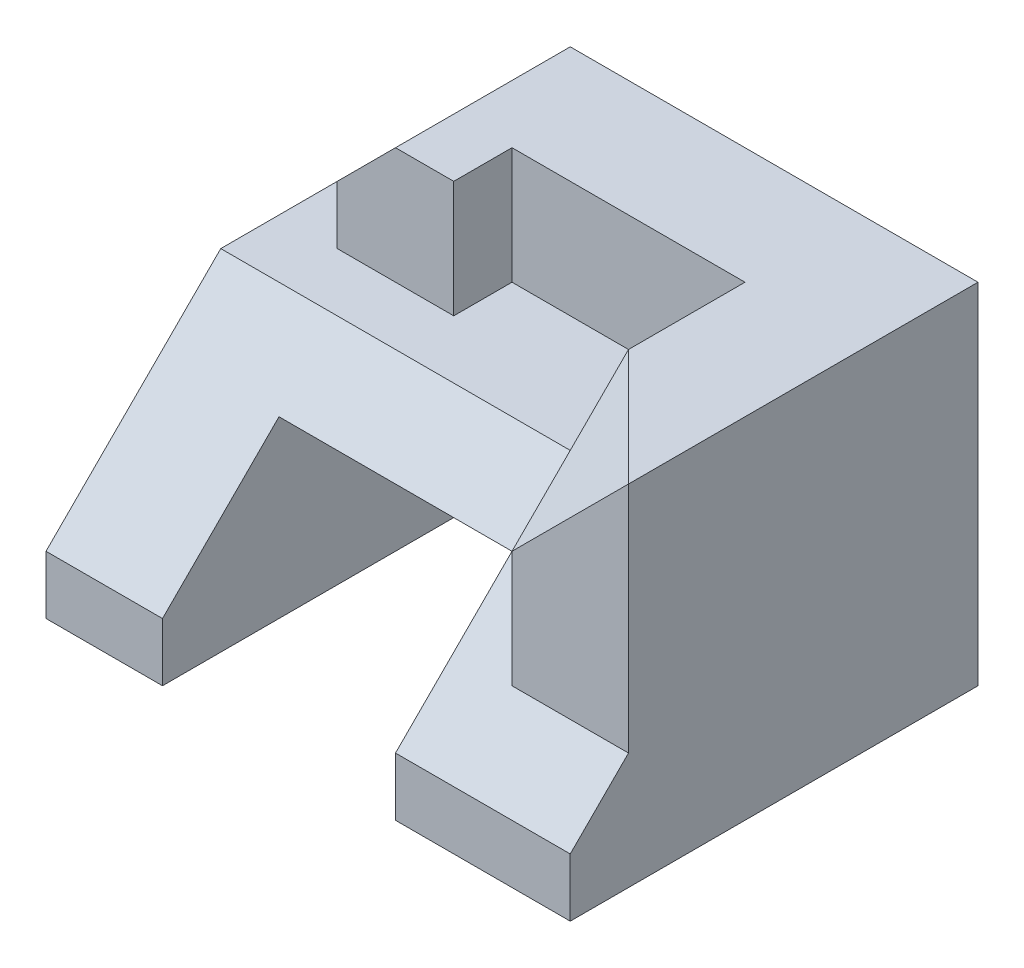
ISO-10303-21;
HEADER;
FILE_DESCRIPTION(('STEP AP214'),'2;1');
FILE_NAME('part.step','',(''),(''),'','','');
FILE_SCHEMA(('AUTOMOTIVE_DESIGN { 1 0 10303 214 1 1 1 1 }'));
ENDSEC;
DATA;
#1=APPLICATION_CONTEXT('core data for automotive mechanical design processes');
#2=APPLICATION_PROTOCOL_DEFINITION('international standard','automotive_design',2000,#1);
#3=PRODUCT_CONTEXT('',#1,'mechanical');
#4=PRODUCT('Part','Part','',(#3));
#5=PRODUCT_RELATED_PRODUCT_CATEGORY('part','',(#4));
#6=PRODUCT_DEFINITION_FORMATION('','',#4);
#7=PRODUCT_DEFINITION_CONTEXT('part definition',#1,'design');
#8=PRODUCT_DEFINITION('design','',#6,#7);
#9=PRODUCT_DEFINITION_SHAPE('','',#8);
#10=(LENGTH_UNIT() NAMED_UNIT(*) SI_UNIT(.MILLI.,.METRE.));
#11=(NAMED_UNIT(*) PLANE_ANGLE_UNIT() SI_UNIT($,.RADIAN.));
#12=(NAMED_UNIT(*) SI_UNIT($,.STERADIAN.) SOLID_ANGLE_UNIT());
#13=UNCERTAINTY_MEASURE_WITH_UNIT(LENGTH_MEASURE(1.E-05),#10,'distance_accuracy_value','');
#14=(GEOMETRIC_REPRESENTATION_CONTEXT(3) GLOBAL_UNCERTAINTY_ASSIGNED_CONTEXT((#13)) GLOBAL_UNIT_ASSIGNED_CONTEXT((#10,
#11,#12)) REPRESENTATION_CONTEXT('',''));
#15=CARTESIAN_POINT('',(0.,0.,0.));
#16=DIRECTION('',(0.,0.,1.));
#17=DIRECTION('',(1.,0.,0.));
#18=AXIS2_PLACEMENT_3D('',#15,#16,#17);
#19=CARTESIAN_POINT('',(25.,10.,15.));
#20=DIRECTION('',(0.,-0.707106781186547,-0.707106781186547));
#21=DIRECTION('',(0.,0.707106781186548,-0.707106781186548));
#22=AXIS2_PLACEMENT_3D('',#19,#20,#21);
#23=PLANE('',#22);
#24=DIRECTION('',(0.,-0.707106781186548,0.707106781186548));
#25=VECTOR('',#24,1.);
#26=CARTESIAN_POINT('',(15.,10.,15.));
#27=LINE('',#26,#25);
#28=CARTESIAN_POINT('',(15.,10.,15.));
#29=VERTEX_POINT('',#28);
#30=CARTESIAN_POINT('',(15.,0.,25.));
#31=VERTEX_POINT('',#30);
#32=EDGE_CURVE('E213',#29,#31,#27,.T.);
#33=ORIENTED_EDGE('',*,*,#32,.F.);
#34=DIRECTION('',(-1.,0.,0.));
#35=VECTOR('',#34,1.);
#36=CARTESIAN_POINT('',(25.,10.,15.));
#37=LINE('',#36,#35);
#38=CARTESIAN_POINT('',(-20.,10.,15.));
#39=VERTEX_POINT('',#38);
#40=EDGE_CURVE('E400',#29,#39,#37,.T.);
#41=ORIENTED_EDGE('',*,*,#40,.T.);
#42=DIRECTION('',(0.,-0.707106781186547,0.707106781186547));
#43=VECTOR('',#42,1.);
#44=CARTESIAN_POINT('',(-20.,10.,15.));
#45=LINE('',#44,#43);
#46=CARTESIAN_POINT('',(-20.,-5.,30.));
#47=VERTEX_POINT('',#46);
#48=EDGE_CURVE('E283',#39,#47,#45,.T.);
#49=ORIENTED_EDGE('',*,*,#48,.T.);
#50=DIRECTION('',(-1.,0.,0.));
#51=VECTOR('',#50,1.);
#52=CARTESIAN_POINT('',(25.,-5.,30.));
#53=LINE('',#52,#51);
#54=CARTESIAN_POINT('',(-9.99999999999999,-5.,30.));
#55=VERTEX_POINT('',#54);
#56=EDGE_CURVE('E399',#55,#47,#53,.T.);
#57=ORIENTED_EDGE('',*,*,#56,.F.);
#58=DIRECTION('',(0.,-0.707106781186548,0.707106781186548));
#59=VECTOR('',#58,1.);
#60=CARTESIAN_POINT('',(-10.,7.5,17.5));
#61=LINE('',#60,#59);
#62=CARTESIAN_POINT('',(-10.,5.,20.));
#63=VERTEX_POINT('',#62);
#64=EDGE_CURVE('E357',#63,#55,#61,.T.);
#65=ORIENTED_EDGE('',*,*,#64,.F.);
#66=DIRECTION('',(-1.,0.,0.));
#67=VECTOR('',#66,1.);
#68=CARTESIAN_POINT('',(-10.,5.,20.));
#69=LINE('',#68,#67);
#70=CARTESIAN_POINT('',(10.,5.,20.));
#71=VERTEX_POINT('',#70);
#72=EDGE_CURVE('E361',#71,#63,#69,.T.);
#73=ORIENTED_EDGE('',*,*,#72,.F.);
#74=DIRECTION('',(0.,0.707106781186548,-0.707106781186548));
#75=VECTOR('',#74,1.);
#76=CARTESIAN_POINT('',(10.,15.,10.));
#77=LINE('',#76,#75);
#78=CARTESIAN_POINT('',(10.,-5.,30.));
#79=VERTEX_POINT('',#78);
#80=EDGE_CURVE('E364',#79,#71,#77,.T.);
#81=ORIENTED_EDGE('',*,*,#80,.F.);
#82=CARTESIAN_POINT('',(25.,-5.,30.));
#83=VERTEX_POINT('',#82);
#84=EDGE_CURVE('E368',#83,#79,#53,.T.);
#85=ORIENTED_EDGE('',*,*,#84,.F.);
#86=DIRECTION('',(0.,-0.707106781186547,0.707106781186547));
#87=VECTOR('',#86,1.);
#88=CARTESIAN_POINT('',(25.,10.,15.));
#89=LINE('',#88,#87);
#90=CARTESIAN_POINT('',(25.,0.,25.));
#91=VERTEX_POINT('',#90);
#92=EDGE_CURVE('E403',#91,#83,#89,.T.);
#93=ORIENTED_EDGE('',*,*,#92,.F.);
#94=DIRECTION('',(-1.,0.,0.));
#95=VECTOR('',#94,1.);
#96=CARTESIAN_POINT('',(25.,0.,25.));
#97=LINE('',#96,#95);
#98=EDGE_CURVE('E196',#91,#31,#97,.T.);
#99=ORIENTED_EDGE('',*,*,#98,.T.);
#100=EDGE_LOOP('',(#33,#41,#49,#57,#65,#73,#81,#85,#93,#99));
#101=FACE_BOUND('',#100,.T.);
#102=ADVANCED_FACE('F33',(#101),#23,.F.);
#103=CARTESIAN_POINT('',(-25.,10.,30.));
#104=DIRECTION('',(0.,-1.,0.));
#105=DIRECTION('',(0.,0.,-1.));
#106=AXIS2_PLACEMENT_3D('',#103,#104,#105);
#107=PLANE('',#106);
#108=ORIENTED_EDGE('',*,*,#40,.F.);
#109=DIRECTION('',(0.,0.,1.));
#110=VECTOR('',#109,1.);
#111=CARTESIAN_POINT('',(15.,10.,5.));
#112=LINE('',#111,#110);
#113=CARTESIAN_POINT('',(15.,10.,5.));
#114=VERTEX_POINT('',#113);
#115=EDGE_CURVE('E231',#114,#29,#112,.T.);
#116=ORIENTED_EDGE('',*,*,#115,.F.);
#117=DIRECTION('',(1.,0.,0.));
#118=VECTOR('',#117,1.);
#119=CARTESIAN_POINT('',(15.,10.,5.));
#120=LINE('',#119,#118);
#121=CARTESIAN_POINT('',(-5.,10.,5.));
#122=VERTEX_POINT('',#121);
#123=EDGE_CURVE('E220',#122,#114,#120,.T.);
#124=ORIENTED_EDGE('',*,*,#123,.F.);
#125=DIRECTION('',(0.,0.,1.));
#126=VECTOR('',#125,1.);
#127=CARTESIAN_POINT('',(-5.,10.,5.));
#128=LINE('',#127,#126);
#129=CARTESIAN_POINT('',(-5.,10.,10.));
#130=VERTEX_POINT('',#129);
#131=EDGE_CURVE('E234',#122,#130,#128,.T.);
#132=ORIENTED_EDGE('',*,*,#131,.T.);
#133=DIRECTION('',(1.,0.,0.));
#134=VECTOR('',#133,1.);
#135=CARTESIAN_POINT('',(-15.,10.,10.));
#136=LINE('',#135,#134);
#137=CARTESIAN_POINT('',(-15.,10.,10.));
#138=VERTEX_POINT('',#137);
#139=EDGE_CURVE('E246',#138,#130,#136,.T.);
#140=ORIENTED_EDGE('',*,*,#139,.F.);
#141=DIRECTION('',(0.,0.,1.));
#142=VECTOR('',#141,1.);
#143=CARTESIAN_POINT('',(-15.,10.,0.));
#144=LINE('',#143,#142);
#145=CARTESIAN_POINT('',(-15.,10.,0.));
#146=VERTEX_POINT('',#145);
#147=EDGE_CURVE('E236',#146,#138,#144,.T.);
#148=ORIENTED_EDGE('',*,*,#147,.F.);
#149=DIRECTION('',(-1.,0.,0.));
#150=VECTOR('',#149,1.);
#151=CARTESIAN_POINT('',(-25.,10.,0.));
#152=LINE('',#151,#150);
#153=CARTESIAN_POINT('',(-20.,10.,0.));
#154=VERTEX_POINT('',#153);
#155=EDGE_CURVE('E289',#146,#154,#152,.T.);
#156=ORIENTED_EDGE('',*,*,#155,.T.);
#157=DIRECTION('',(0.,0.,1.));
#158=VECTOR('',#157,1.);
#159=CARTESIAN_POINT('',(-20.,10.,0.));
#160=LINE('',#159,#158);
#161=CARTESIAN_POINT('',(-20.,10.,10.));
#162=VERTEX_POINT('',#161);
#163=EDGE_CURVE('E376',#154,#162,#160,.T.);
#164=ORIENTED_EDGE('',*,*,#163,.T.);
#165=DIRECTION('',(0.,0.,1.));
#166=VECTOR('',#165,1.);
#167=CARTESIAN_POINT('',(-20.,10.,10.));
#168=LINE('',#167,#166);
#169=EDGE_CURVE('E309',#162,#39,#168,.T.);
#170=ORIENTED_EDGE('',*,*,#169,.T.);
#171=EDGE_LOOP('',(#108,#116,#124,#132,#140,#148,#156,#164,#170));
#172=FACE_BOUND('',#171,.T.);
#173=ADVANCED_FACE('F434',(#172),#107,.F.);
#174=CARTESIAN_POINT('',(-15.,20.,10.));
#175=DIRECTION('',(0.,0.,-1.));
#176=DIRECTION('',(-1.,0.,0.));
#177=AXIS2_PLACEMENT_3D('',#174,#175,#176);
#178=PLANE('',#177);
#179=DIRECTION('',(1.,0.,0.));
#180=VECTOR('',#179,1.);
#181=CARTESIAN_POINT('',(-15.,20.,10.));
#182=LINE('',#181,#180);
#183=CARTESIAN_POINT('',(-10.,20.,10.));
#184=VERTEX_POINT('',#183);
#185=CARTESIAN_POINT('',(-5.,20.,10.));
#186=VERTEX_POINT('',#185);
#187=EDGE_CURVE('E243',#184,#186,#182,.T.);
#188=ORIENTED_EDGE('',*,*,#187,.F.);
#189=DIRECTION('',(0.707106781186548,0.707106781186548,0.));
#190=VECTOR('',#189,1.);
#191=CARTESIAN_POINT('',(-10.,20.,10.));
#192=LINE('',#191,#190);
#193=CARTESIAN_POINT('',(-15.,15.,10.));
#194=VERTEX_POINT('',#193);
#195=EDGE_CURVE('E208',#194,#184,#192,.T.);
#196=ORIENTED_EDGE('',*,*,#195,.F.);
#197=DIRECTION('',(0.,-1.,0.));
#198=VECTOR('',#197,1.);
#199=CARTESIAN_POINT('',(-15.,20.,10.));
#200=LINE('',#199,#198);
#201=EDGE_CURVE('E245',#194,#138,#200,.T.);
#202=ORIENTED_EDGE('',*,*,#201,.T.);
#203=ORIENTED_EDGE('',*,*,#139,.T.);
#204=DIRECTION('',(0.,-1.,0.));
#205=VECTOR('',#204,1.);
#206=CARTESIAN_POINT('',(-5.,10.,10.));
#207=LINE('',#206,#205);
#208=EDGE_CURVE('E218',#186,#130,#207,.T.);
#209=ORIENTED_EDGE('',*,*,#208,.F.);
#210=EDGE_LOOP('',(#188,#196,#202,#203,#209));
#211=FACE_BOUND('',#210,.T.);
#212=ADVANCED_FACE('F419',(#211),#178,.F.);
#213=CARTESIAN_POINT('',(-25.,-10.,30.));
#214=DIRECTION('',(0.,1.,0.));
#215=DIRECTION('',(0.,0.,1.));
#216=AXIS2_PLACEMENT_3D('',#213,#214,#215);
#217=PLANE('',#216);
#218=DIRECTION('',(-1.,0.,0.));
#219=VECTOR('',#218,1.);
#220=CARTESIAN_POINT('',(-15.,-10.,-5.));
#221=LINE('',#220,#219);
#222=CARTESIAN_POINT('',(-10.,-10.,-5.));
#223=VERTEX_POINT('',#222);
#224=CARTESIAN_POINT('',(-15.,-10.,-5.));
#225=VERTEX_POINT('',#224);
#226=EDGE_CURVE('E266',#223,#225,#221,.T.);
#227=ORIENTED_EDGE('',*,*,#226,.F.);
#228=DIRECTION('',(0.,0.,1.));
#229=VECTOR('',#228,1.);
#230=CARTESIAN_POINT('',(-10.,-10.,0.));
#231=LINE('',#230,#229);
#232=CARTESIAN_POINT('',(-10.,-10.,30.));
#233=VERTEX_POINT('',#232);
#234=EDGE_CURVE('E286',#223,#233,#231,.T.);
#235=ORIENTED_EDGE('',*,*,#234,.T.);
#236=DIRECTION('',(1.,0.,0.));
#237=VECTOR('',#236,1.);
#238=CARTESIAN_POINT('',(-25.,-10.,30.));
#239=LINE('',#238,#237);
#240=CARTESIAN_POINT('',(-20.,-10.,30.));
#241=VERTEX_POINT('',#240);
#242=EDGE_CURVE('E319',#241,#233,#239,.T.);
#243=ORIENTED_EDGE('',*,*,#242,.F.);
#244=DIRECTION('',(0.,0.,1.));
#245=VECTOR('',#244,1.);
#246=CARTESIAN_POINT('',(-20.,-10.,10.));
#247=LINE('',#246,#245);
#248=CARTESIAN_POINT('',(-20.,-10.,10.));
#249=VERTEX_POINT('',#248);
#250=EDGE_CURVE('E387',#249,#241,#247,.T.);
#251=ORIENTED_EDGE('',*,*,#250,.F.);
#252=DIRECTION('',(1.,0.,0.));
#253=VECTOR('',#252,1.);
#254=CARTESIAN_POINT('',(-20.,-10.,10.));
#255=LINE('',#254,#253);
#256=CARTESIAN_POINT('',(-25.,-10.,10.));
#257=VERTEX_POINT('',#256);
#258=EDGE_CURVE('E337',#257,#249,#255,.T.);
#259=ORIENTED_EDGE('',*,*,#258,.F.);
#260=DIRECTION('',(0.,0.,-1.));
#261=VECTOR('',#260,1.);
#262=CARTESIAN_POINT('',(-25.,-10.,30.));
#263=LINE('',#262,#261);
#264=CARTESIAN_POINT('',(-25.,-10.,0.));
#265=VERTEX_POINT('',#264);
#266=EDGE_CURVE('E41',#257,#265,#263,.T.);
#267=ORIENTED_EDGE('',*,*,#266,.T.);
#268=DIRECTION('',(1.,0.,0.));
#269=VECTOR('',#268,1.);
#270=CARTESIAN_POINT('',(-25.,-10.,0.));
#271=LINE('',#270,#269);
#272=CARTESIAN_POINT('',(-15.,-10.,0.));
#273=VERTEX_POINT('',#272);
#274=EDGE_CURVE('E278',#265,#273,#271,.T.);
#275=ORIENTED_EDGE('',*,*,#274,.T.);
#276=DIRECTION('',(0.,0.,1.));
#277=VECTOR('',#276,1.);
#278=CARTESIAN_POINT('',(-15.,-10.,-5.));
#279=LINE('',#278,#277);
#280=EDGE_CURVE('E203',#225,#273,#279,.T.);
#281=ORIENTED_EDGE('',*,*,#280,.F.);
#282=EDGE_LOOP('',(#227,#235,#243,#251,#259,#267,#275,#281));
#283=FACE_BOUND('',#282,.T.);
#284=ADVANCED_FACE('F333',(#283),#217,.F.);
#285=CARTESIAN_POINT('',(0.,0.,0.));
#286=DIRECTION('',(0.,0.,1.));
#287=DIRECTION('',(1.,0.,0.));
#288=AXIS2_PLACEMENT_3D('',#285,#286,#287);
#289=PLANE('',#288);
#290=DIRECTION('',(0.,1.,0.));
#291=VECTOR('',#290,1.);
#292=CARTESIAN_POINT('',(-15.,20.,0.));
#293=LINE('',#292,#291);
#294=EDGE_CURVE('E261',#273,#146,#293,.T.);
#295=ORIENTED_EDGE('',*,*,#294,.F.);
#296=ORIENTED_EDGE('',*,*,#274,.F.);
#297=DIRECTION('',(0.,-1.,0.));
#298=VECTOR('',#297,1.);
#299=CARTESIAN_POINT('',(-25.,10.,0.));
#300=LINE('',#299,#298);
#301=CARTESIAN_POINT('',(-25.,0.,0.));
#302=VERTEX_POINT('',#301);
#303=EDGE_CURVE('E323',#302,#265,#300,.T.);
#304=ORIENTED_EDGE('',*,*,#303,.F.);
#305=DIRECTION('',(0.447213595499958,0.894427190999916,0.));
#306=VECTOR('',#305,1.);
#307=CARTESIAN_POINT('',(-20.,10.,0.));
#308=LINE('',#307,#306);
#309=EDGE_CURVE('E372',#302,#154,#308,.T.);
#310=ORIENTED_EDGE('',*,*,#309,.T.);
#311=ORIENTED_EDGE('',*,*,#155,.F.);
#312=EDGE_LOOP('',(#295,#296,#304,#310,#311));
#313=FACE_BOUND('',#312,.T.);
#314=ADVANCED_FACE('F342',(#313),#289,.F.);
#315=CARTESIAN_POINT('',(0.,0.,30.));
#316=DIRECTION('',(0.,0.,1.));
#317=DIRECTION('',(1.,0.,0.));
#318=AXIS2_PLACEMENT_3D('',#315,#316,#317);
#319=PLANE('',#318);
#320=ORIENTED_EDGE('',*,*,#56,.T.);
#321=DIRECTION('',(0.,1.,0.));
#322=VECTOR('',#321,1.);
#323=CARTESIAN_POINT('',(-20.,10.,30.));
#324=LINE('',#323,#322);
#325=EDGE_CURVE('E379',#241,#47,#324,.T.);
#326=ORIENTED_EDGE('',*,*,#325,.F.);
#327=ORIENTED_EDGE('',*,*,#242,.T.);
#328=DIRECTION('',(0.,-1.,0.));
#329=VECTOR('',#328,1.);
#330=CARTESIAN_POINT('',(-10.,-10.,30.));
#331=LINE('',#330,#329);
#332=EDGE_CURVE('E295',#55,#233,#331,.T.);
#333=ORIENTED_EDGE('',*,*,#332,.F.);
#334=EDGE_LOOP('',(#320,#326,#327,#333));
#335=FACE_BOUND('',#334,.T.);
#336=ADVANCED_FACE('F398',(#335),#319,.T.);
#337=CARTESIAN_POINT('',(25.,10.,30.));
#338=DIRECTION('',(-1.,0.,0.));
#339=DIRECTION('',(0.,-1.,0.));
#340=AXIS2_PLACEMENT_3D('',#337,#338,#339);
#341=PLANE('',#340);
#342=DIRECTION('',(0.,1.,0.));
#343=VECTOR('',#342,1.);
#344=CARTESIAN_POINT('',(25.,20.,25.));
#345=LINE('',#344,#343);
#346=CARTESIAN_POINT('',(25.,20.,25.));
#347=VERTEX_POINT('',#346);
#348=EDGE_CURVE('E199',#91,#347,#345,.T.);
#349=ORIENTED_EDGE('',*,*,#348,.F.);
#350=ORIENTED_EDGE('',*,*,#92,.T.);
#351=DIRECTION('',(0.,1.,0.));
#352=VECTOR('',#351,1.);
#353=CARTESIAN_POINT('',(25.,10.,30.));
#354=LINE('',#353,#352);
#355=CARTESIAN_POINT('',(25.,-10.,30.));
#356=VERTEX_POINT('',#355);
#357=EDGE_CURVE('E315',#356,#83,#354,.T.);
#358=ORIENTED_EDGE('',*,*,#357,.F.);
#359=DIRECTION('',(0.,0.,-1.));
#360=VECTOR('',#359,1.);
#361=CARTESIAN_POINT('',(25.,-10.,30.));
#362=LINE('',#361,#360);
#363=CARTESIAN_POINT('',(25.,-10.,-5.));
#364=VERTEX_POINT('',#363);
#365=EDGE_CURVE('E321',#356,#364,#362,.T.);
#366=ORIENTED_EDGE('',*,*,#365,.T.);
#367=DIRECTION('',(0.,-1.,0.));
#368=VECTOR('',#367,1.);
#369=CARTESIAN_POINT('',(25.,-10.,-5.));
#370=LINE('',#369,#368);
#371=CARTESIAN_POINT('',(25.,20.,-5.));
#372=VERTEX_POINT('',#371);
#373=EDGE_CURVE('E202',#372,#364,#370,.T.);
#374=ORIENTED_EDGE('',*,*,#373,.F.);
#375=DIRECTION('',(0.,0.,1.));
#376=VECTOR('',#375,1.);
#377=CARTESIAN_POINT('',(25.,20.,-5.));
#378=LINE('',#377,#376);
#379=EDGE_CURVE('E192',#372,#347,#378,.T.);
#380=ORIENTED_EDGE('',*,*,#379,.T.);
#381=EDGE_LOOP('',(#349,#350,#358,#366,#374,#380));
#382=FACE_BOUND('',#381,.T.);
#383=ADVANCED_FACE('F35',(#382),#341,.F.);
#384=CARTESIAN_POINT('',(-25.,10.,30.));
#385=DIRECTION('',(1.,0.,0.));
#386=DIRECTION('',(0.,1.,0.));
#387=AXIS2_PLACEMENT_3D('',#384,#385,#386);
#388=PLANE('',#387);
#389=DIRECTION('',(0.,-1.,0.));
#390=VECTOR('',#389,1.);
#391=CARTESIAN_POINT('',(-25.,-10.,10.));
#392=LINE('',#391,#390);
#393=CARTESIAN_POINT('',(-25.,0.,10.));
#394=VERTEX_POINT('',#393);
#395=EDGE_CURVE('E381',#394,#257,#392,.T.);
#396=ORIENTED_EDGE('',*,*,#395,.F.);
#397=DIRECTION('',(0.,0.,1.));
#398=VECTOR('',#397,1.);
#399=CARTESIAN_POINT('',(-25.,0.,0.));
#400=LINE('',#399,#398);
#401=EDGE_CURVE('E374',#302,#394,#400,.T.);
#402=ORIENTED_EDGE('',*,*,#401,.F.);
#403=ORIENTED_EDGE('',*,*,#303,.T.);
#404=ORIENTED_EDGE('',*,*,#266,.F.);
#405=EDGE_LOOP('',(#396,#402,#403,#404));
#406=FACE_BOUND('',#405,.T.);
#407=ADVANCED_FACE('F442',(#406),#388,.F.);
#408=DIRECTION('',(0.,0.,1.));
#409=VECTOR('',#408,1.);
#410=CARTESIAN_POINT('',(10.,-10.,0.));
#411=LINE('',#410,#409);
#412=CARTESIAN_POINT('',(10.,-10.,-5.));
#413=VERTEX_POINT('',#412);
#414=CARTESIAN_POINT('',(10.,-10.,30.));
#415=VERTEX_POINT('',#414);
#416=EDGE_CURVE('E293',#413,#415,#411,.T.);
#417=ORIENTED_EDGE('',*,*,#416,.F.);
#418=EDGE_CURVE('E262',#364,#413,#221,.T.);
#419=ORIENTED_EDGE('',*,*,#418,.F.);
#420=ORIENTED_EDGE('',*,*,#365,.F.);
#421=EDGE_CURVE('E318',#415,#356,#239,.T.);
#422=ORIENTED_EDGE('',*,*,#421,.F.);
#423=EDGE_LOOP('',(#417,#419,#420,#422));
#424=FACE_BOUND('',#423,.T.);
#425=ADVANCED_FACE('F413',(#424),#217,.F.);
#426=ORIENTED_EDGE('',*,*,#84,.T.);
#427=DIRECTION('',(0.,1.,0.));
#428=VECTOR('',#427,1.);
#429=CARTESIAN_POINT('',(10.,5.,30.));
#430=LINE('',#429,#428);
#431=EDGE_CURVE('E303',#415,#79,#430,.T.);
#432=ORIENTED_EDGE('',*,*,#431,.F.);
#433=ORIENTED_EDGE('',*,*,#421,.T.);
#434=ORIENTED_EDGE('',*,*,#357,.T.);
#435=EDGE_LOOP('',(#426,#432,#433,#434));
#436=FACE_BOUND('',#435,.T.);
#437=ADVANCED_FACE('F408',(#436),#319,.T.);
#438=CARTESIAN_POINT('',(-10.,-10.,0.));
#439=DIRECTION('',(-1.,0.,0.));
#440=DIRECTION('',(0.,0.,1.));
#441=AXIS2_PLACEMENT_3D('',#438,#439,#440);
#442=PLANE('',#441);
#443=DIRECTION('',(0.,0.,1.));
#444=VECTOR('',#443,1.);
#445=CARTESIAN_POINT('',(-10.,5.,0.));
#446=LINE('',#445,#444);
#447=CARTESIAN_POINT('',(-10.,5.,-5.));
#448=VERTEX_POINT('',#447);
#449=EDGE_CURVE('E290',#448,#63,#446,.T.);
#450=ORIENTED_EDGE('',*,*,#449,.T.);
#451=ORIENTED_EDGE('',*,*,#64,.T.);
#452=ORIENTED_EDGE('',*,*,#332,.T.);
#453=ORIENTED_EDGE('',*,*,#234,.F.);
#454=DIRECTION('',(0.,-1.,0.));
#455=VECTOR('',#454,1.);
#456=CARTESIAN_POINT('',(-10.,0.,-5.));
#457=LINE('',#456,#455);
#458=EDGE_CURVE('E258',#448,#223,#457,.T.);
#459=ORIENTED_EDGE('',*,*,#458,.F.);
#460=EDGE_LOOP('',(#450,#451,#452,#453,#459));
#461=FACE_BOUND('',#460,.T.);
#462=ADVANCED_FACE('F356',(#461),#442,.F.);
#463=CARTESIAN_POINT('',(-10.,5.,0.));
#464=DIRECTION('',(0.,1.,0.));
#465=DIRECTION('',(0.,0.,1.));
#466=AXIS2_PLACEMENT_3D('',#463,#464,#465);
#467=PLANE('',#466);
#468=DIRECTION('',(0.,0.,1.));
#469=VECTOR('',#468,1.);
#470=CARTESIAN_POINT('',(10.,5.,0.));
#471=LINE('',#470,#469);
#472=CARTESIAN_POINT('',(10.,5.,-5.));
#473=VERTEX_POINT('',#472);
#474=EDGE_CURVE('E294',#473,#71,#471,.T.);
#475=ORIENTED_EDGE('',*,*,#474,.T.);
#476=ORIENTED_EDGE('',*,*,#72,.T.);
#477=ORIENTED_EDGE('',*,*,#449,.F.);
#478=DIRECTION('',(-1.,0.,0.));
#479=VECTOR('',#478,1.);
#480=CARTESIAN_POINT('',(0.,5.,-5.));
#481=LINE('',#480,#479);
#482=EDGE_CURVE('E255',#473,#448,#481,.T.);
#483=ORIENTED_EDGE('',*,*,#482,.F.);
#484=EDGE_LOOP('',(#475,#476,#477,#483));
#485=FACE_BOUND('',#484,.T.);
#486=ADVANCED_FACE('F360',(#485),#467,.F.);
#487=CARTESIAN_POINT('',(10.,5.,0.));
#488=DIRECTION('',(1.,0.,0.));
#489=DIRECTION('',(0.,1.,0.));
#490=AXIS2_PLACEMENT_3D('',#487,#488,#489);
#491=PLANE('',#490);
#492=ORIENTED_EDGE('',*,*,#431,.T.);
#493=ORIENTED_EDGE('',*,*,#80,.T.);
#494=ORIENTED_EDGE('',*,*,#474,.F.);
#495=DIRECTION('',(0.,1.,0.));
#496=VECTOR('',#495,1.);
#497=CARTESIAN_POINT('',(10.,0.,-5.));
#498=LINE('',#497,#496);
#499=EDGE_CURVE('E252',#413,#473,#498,.T.);
#500=ORIENTED_EDGE('',*,*,#499,.F.);
#501=ORIENTED_EDGE('',*,*,#416,.T.);
#502=EDGE_LOOP('',(#492,#493,#494,#500,#501));
#503=FACE_BOUND('',#502,.T.);
#504=ADVANCED_FACE('F464',(#503),#491,.F.);
#505=CARTESIAN_POINT('',(-20.,10.,10.));
#506=DIRECTION('',(1.,0.,0.));
#507=DIRECTION('',(0.,0.,-1.));
#508=AXIS2_PLACEMENT_3D('',#505,#506,#507);
#509=PLANE('',#508);
#510=ORIENTED_EDGE('',*,*,#325,.T.);
#511=ORIENTED_EDGE('',*,*,#48,.F.);
#512=ORIENTED_EDGE('',*,*,#169,.F.);
#513=DIRECTION('',(0.,1.,0.));
#514=VECTOR('',#513,1.);
#515=CARTESIAN_POINT('',(-20.,10.,10.));
#516=LINE('',#515,#514);
#517=EDGE_CURVE('E384',#249,#162,#516,.T.);
#518=ORIENTED_EDGE('',*,*,#517,.F.);
#519=ORIENTED_EDGE('',*,*,#250,.T.);
#520=EDGE_LOOP('',(#510,#511,#512,#518,#519));
#521=FACE_BOUND('',#520,.T.);
#522=ADVANCED_FACE('F393',(#521),#509,.F.);
#523=CARTESIAN_POINT('',(0.,0.,10.));
#524=DIRECTION('',(0.,0.,-1.));
#525=DIRECTION('',(-1.,0.,0.));
#526=AXIS2_PLACEMENT_3D('',#523,#524,#525);
#527=PLANE('',#526);
#528=ORIENTED_EDGE('',*,*,#517,.T.);
#529=DIRECTION('',(0.447213595499958,0.894427190999916,0.));
#530=VECTOR('',#529,1.);
#531=CARTESIAN_POINT('',(-20.,10.,10.));
#532=LINE('',#531,#530);
#533=EDGE_CURVE('E366',#394,#162,#532,.T.);
#534=ORIENTED_EDGE('',*,*,#533,.F.);
#535=ORIENTED_EDGE('',*,*,#395,.T.);
#536=ORIENTED_EDGE('',*,*,#258,.T.);
#537=EDGE_LOOP('',(#528,#534,#535,#536));
#538=FACE_BOUND('',#537,.T.);
#539=ADVANCED_FACE('F441',(#538),#527,.F.);
#540=CARTESIAN_POINT('',(-20.,10.,0.));
#541=DIRECTION('',(0.894427190999916,-0.447213595499958,0.));
#542=DIRECTION('',(0.447213595499958,0.894427190999916,0.));
#543=AXIS2_PLACEMENT_3D('',#540,#541,#542);
#544=PLANE('',#543);
#545=ORIENTED_EDGE('',*,*,#533,.T.);
#546=ORIENTED_EDGE('',*,*,#163,.F.);
#547=ORIENTED_EDGE('',*,*,#309,.F.);
#548=ORIENTED_EDGE('',*,*,#401,.T.);
#549=EDGE_LOOP('',(#545,#546,#547,#548));
#550=FACE_BOUND('',#549,.T.);
#551=ADVANCED_FACE('F437',(#550),#544,.F.);
#552=CARTESIAN_POINT('',(-15.,20.,-5.));
#553=DIRECTION('',(1.,0.,0.));
#554=DIRECTION('',(0.,1.,0.));
#555=AXIS2_PLACEMENT_3D('',#552,#553,#554);
#556=PLANE('',#555);
#557=ORIENTED_EDGE('',*,*,#201,.F.);
#558=DIRECTION('',(0.,0.,1.));
#559=VECTOR('',#558,1.);
#560=CARTESIAN_POINT('',(-15.,15.,-5.000025));
#561=LINE('',#560,#559);
#562=CARTESIAN_POINT('',(-15.,15.,-5.));
#563=VERTEX_POINT('',#562);
#564=EDGE_CURVE('E211',#563,#194,#561,.T.);
#565=ORIENTED_EDGE('',*,*,#564,.F.);
#566=DIRECTION('',(0.,1.,0.));
#567=VECTOR('',#566,1.);
#568=CARTESIAN_POINT('',(-15.,20.,-5.));
#569=LINE('',#568,#567);
#570=EDGE_CURVE('E265',#225,#563,#569,.T.);
#571=ORIENTED_EDGE('',*,*,#570,.F.);
#572=ORIENTED_EDGE('',*,*,#280,.T.);
#573=ORIENTED_EDGE('',*,*,#294,.T.);
#574=ORIENTED_EDGE('',*,*,#147,.T.);
#575=EDGE_LOOP('',(#557,#565,#571,#572,#573,#574));
#576=FACE_BOUND('',#575,.T.);
#577=ADVANCED_FACE('F347',(#576),#556,.F.);
#578=CARTESIAN_POINT('',(25.,20.,-5.));
#579=DIRECTION('',(0.,-1.,0.));
#580=DIRECTION('',(0.,0.,-1.));
#581=AXIS2_PLACEMENT_3D('',#578,#579,#580);
#582=PLANE('',#581);
#583=DIRECTION('',(0.,0.,1.));
#584=VECTOR('',#583,1.);
#585=CARTESIAN_POINT('',(15.,20.,5.));
#586=LINE('',#585,#584);
#587=CARTESIAN_POINT('',(15.,20.,5.));
#588=VERTEX_POINT('',#587);
#589=CARTESIAN_POINT('',(15.,20.,15.));
#590=VERTEX_POINT('',#589);
#591=EDGE_CURVE('E195',#588,#590,#586,.T.);
#592=ORIENTED_EDGE('',*,*,#591,.T.);
#593=DIRECTION('',(-0.707106781186547,0.,-0.707106781186548));
#594=VECTOR('',#593,1.);
#595=CARTESIAN_POINT('',(15.,20.,15.));
#596=LINE('',#595,#594);
#597=EDGE_CURVE('E181',#347,#590,#596,.T.);
#598=ORIENTED_EDGE('',*,*,#597,.F.);
#599=ORIENTED_EDGE('',*,*,#379,.F.);
#600=DIRECTION('',(1.,0.,0.));
#601=VECTOR('',#600,1.);
#602=CARTESIAN_POINT('',(25.,20.,-5.));
#603=LINE('',#602,#601);
#604=CARTESIAN_POINT('',(-9.99999999999999,20.,-5.));
#605=VERTEX_POINT('',#604);
#606=EDGE_CURVE('E269',#605,#372,#603,.T.);
#607=ORIENTED_EDGE('',*,*,#606,.F.);
#608=DIRECTION('',(0.,0.,1.));
#609=VECTOR('',#608,1.);
#610=CARTESIAN_POINT('',(-10.,20.,-5.000025));
#611=LINE('',#610,#609);
#612=EDGE_CURVE('E56',#605,#184,#611,.T.);
#613=ORIENTED_EDGE('',*,*,#612,.T.);
#614=ORIENTED_EDGE('',*,*,#187,.T.);
#615=DIRECTION('',(0.,0.,1.));
#616=VECTOR('',#615,1.);
#617=CARTESIAN_POINT('',(-5.,20.,5.));
#618=LINE('',#617,#616);
#619=CARTESIAN_POINT('',(-5.,20.,5.));
#620=VERTEX_POINT('',#619);
#621=EDGE_CURVE('E237',#620,#186,#618,.T.);
#622=ORIENTED_EDGE('',*,*,#621,.F.);
#623=DIRECTION('',(-1.,0.,0.));
#624=VECTOR('',#623,1.);
#625=CARTESIAN_POINT('',(-5.,20.,5.));
#626=LINE('',#625,#624);
#627=EDGE_CURVE('E226',#588,#620,#626,.T.);
#628=ORIENTED_EDGE('',*,*,#627,.F.);
#629=EDGE_LOOP('',(#592,#598,#599,#607,#613,#614,#622,#628));
#630=FACE_BOUND('',#629,.T.);
#631=ADVANCED_FACE('F190',(#630),#582,.F.);
#632=CARTESIAN_POINT('',(0.,0.,-5.));
#633=DIRECTION('',(0.,0.,1.));
#634=DIRECTION('',(1.,0.,0.));
#635=AXIS2_PLACEMENT_3D('',#632,#633,#634);
#636=PLANE('',#635);
#637=ORIENTED_EDGE('',*,*,#570,.T.);
#638=DIRECTION('',(0.707106781186548,0.707106781186548,0.));
#639=VECTOR('',#638,1.);
#640=CARTESIAN_POINT('',(-15.,15.,-5.));
#641=LINE('',#640,#639);
#642=EDGE_CURVE('E11',#563,#605,#641,.T.);
#643=ORIENTED_EDGE('',*,*,#642,.T.);
#644=ORIENTED_EDGE('',*,*,#606,.T.);
#645=ORIENTED_EDGE('',*,*,#373,.T.);
#646=ORIENTED_EDGE('',*,*,#418,.T.);
#647=ORIENTED_EDGE('',*,*,#499,.T.);
#648=ORIENTED_EDGE('',*,*,#482,.T.);
#649=ORIENTED_EDGE('',*,*,#458,.T.);
#650=ORIENTED_EDGE('',*,*,#226,.T.);
#651=EDGE_LOOP('',(#637,#643,#644,#645,#646,#647,#648,#649,#650));
#652=FACE_BOUND('',#651,.T.);
#653=ADVANCED_FACE('F353',(#652),#636,.F.);
#654=CARTESIAN_POINT('',(-5.,10.,5.));
#655=DIRECTION('',(-1.,0.,0.));
#656=DIRECTION('',(0.,0.,1.));
#657=AXIS2_PLACEMENT_3D('',#654,#655,#656);
#658=PLANE('',#657);
#659=ORIENTED_EDGE('',*,*,#208,.T.);
#660=ORIENTED_EDGE('',*,*,#131,.F.);
#661=DIRECTION('',(0.,-1.,0.));
#662=VECTOR('',#661,1.);
#663=CARTESIAN_POINT('',(-5.,10.,5.));
#664=LINE('',#663,#662);
#665=EDGE_CURVE('E228',#620,#122,#664,.T.);
#666=ORIENTED_EDGE('',*,*,#665,.F.);
#667=ORIENTED_EDGE('',*,*,#621,.T.);
#668=EDGE_LOOP('',(#659,#660,#666,#667));
#669=FACE_BOUND('',#668,.T.);
#670=ADVANCED_FACE('F421',(#669),#658,.F.);
#671=CARTESIAN_POINT('',(15.,20.,5.));
#672=DIRECTION('',(1.,0.,0.));
#673=DIRECTION('',(0.,1.,0.));
#674=AXIS2_PLACEMENT_3D('',#671,#672,#673);
#675=PLANE('',#674);
#676=DIRECTION('',(0.,-1.,0.));
#677=VECTOR('',#676,1.);
#678=CARTESIAN_POINT('',(15.,10.,25.));
#679=LINE('',#678,#677);
#680=CARTESIAN_POINT('',(15.,9.99999999999999,25.));
#681=VERTEX_POINT('',#680);
#682=EDGE_CURVE('E209',#681,#31,#679,.T.);
#683=ORIENTED_EDGE('',*,*,#682,.F.);
#684=DIRECTION('',(0.,-0.707106781186548,0.707106781186547));
#685=VECTOR('',#684,1.);
#686=CARTESIAN_POINT('',(15.,9.99999999999999,25.));
#687=LINE('',#686,#685);
#688=EDGE_CURVE('E48',#590,#681,#687,.T.);
#689=ORIENTED_EDGE('',*,*,#688,.F.);
#690=ORIENTED_EDGE('',*,*,#591,.F.);
#691=DIRECTION('',(0.,1.,0.));
#692=VECTOR('',#691,1.);
#693=CARTESIAN_POINT('',(15.,20.,5.));
#694=LINE('',#693,#692);
#695=EDGE_CURVE('E223',#114,#588,#694,.T.);
#696=ORIENTED_EDGE('',*,*,#695,.F.);
#697=ORIENTED_EDGE('',*,*,#115,.T.);
#698=ORIENTED_EDGE('',*,*,#32,.T.);
#699=EDGE_LOOP('',(#683,#689,#690,#696,#697,#698));
#700=FACE_BOUND('',#699,.T.);
#701=ADVANCED_FACE('F428',(#700),#675,.F.);
#702=CARTESIAN_POINT('',(0.,0.,5.));
#703=DIRECTION('',(0.,0.,-1.));
#704=DIRECTION('',(-1.,0.,0.));
#705=AXIS2_PLACEMENT_3D('',#702,#703,#704);
#706=PLANE('',#705);
#707=ORIENTED_EDGE('',*,*,#123,.T.);
#708=ORIENTED_EDGE('',*,*,#695,.T.);
#709=ORIENTED_EDGE('',*,*,#627,.T.);
#710=ORIENTED_EDGE('',*,*,#665,.T.);
#711=EDGE_LOOP('',(#707,#708,#709,#710));
#712=FACE_BOUND('',#711,.T.);
#713=ADVANCED_FACE('F425',(#712),#706,.F.);
#714=CARTESIAN_POINT('',(-10.,20.,-5.000025));
#715=DIRECTION('',(0.707106781186548,-0.707106781186548,0.));
#716=DIRECTION('',(0.707106781186548,0.707106781186548,0.));
#717=AXIS2_PLACEMENT_3D('',#714,#715,#716);
#718=PLANE('',#717);
#719=ORIENTED_EDGE('',*,*,#564,.T.);
#720=ORIENTED_EDGE('',*,*,#195,.T.);
#721=ORIENTED_EDGE('',*,*,#612,.F.);
#722=ORIENTED_EDGE('',*,*,#642,.F.);
#723=EDGE_LOOP('',(#719,#720,#721,#722));
#724=FACE_BOUND('',#723,.T.);
#725=ADVANCED_FACE('F608',(#724),#718,.F.);
#726=CARTESIAN_POINT('',(0.,0.,25.));
#727=DIRECTION('',(0.,0.,-1.));
#728=DIRECTION('',(-1.,0.,0.));
#729=AXIS2_PLACEMENT_3D('',#726,#727,#728);
#730=PLANE('',#729);
#731=ORIENTED_EDGE('',*,*,#348,.T.);
#732=DIRECTION('',(0.707106781186547,0.707106781186548,0.));
#733=VECTOR('',#732,1.);
#734=CARTESIAN_POINT('',(25.,20.,25.));
#735=LINE('',#734,#733);
#736=EDGE_CURVE('E178',#681,#347,#735,.T.);
#737=ORIENTED_EDGE('',*,*,#736,.F.);
#738=ORIENTED_EDGE('',*,*,#682,.T.);
#739=ORIENTED_EDGE('',*,*,#98,.F.);
#740=EDGE_LOOP('',(#731,#737,#738,#739));
#741=FACE_BOUND('',#740,.T.);
#742=ADVANCED_FACE('F205',(#741),#730,.F.);
#743=CARTESIAN_POINT('',(-6.66666666666666,6.66666666666666,6.66666666666666));
#744=DIRECTION('',(0.577350269189626,-0.577350269189626,-0.577350269189626));
#745=DIRECTION('',(-0.707106781186547,0.,-0.707106781186547));
#746=AXIS2_PLACEMENT_3D('',#743,#744,#745);
#747=PLANE('',#746);
#748=ORIENTED_EDGE('',*,*,#688,.T.);
#749=ORIENTED_EDGE('',*,*,#736,.T.);
#750=ORIENTED_EDGE('',*,*,#597,.T.);
#751=EDGE_LOOP('',(#748,#749,#750));
#752=FACE_BOUND('',#751,.T.);
#753=ADVANCED_FACE('F180',(#752),#747,.F.);
#754=CLOSED_SHELL('',(#102,#173,#212,#284,#314,#336,#383,#407,#425,#437,#462,#486,#504,#522,
#539,#551,#577,#631,#653,#670,#701,#713,#725,#742,#753));
#755=MANIFOLD_SOLID_BREP('B2',#754);
#756=ADVANCED_BREP_SHAPE_REPRESENTATION('',(#18,#755),#14);
#757=SHAPE_DEFINITION_REPRESENTATION(#9,#756);
ENDSEC;
END-ISO-10303-21;
